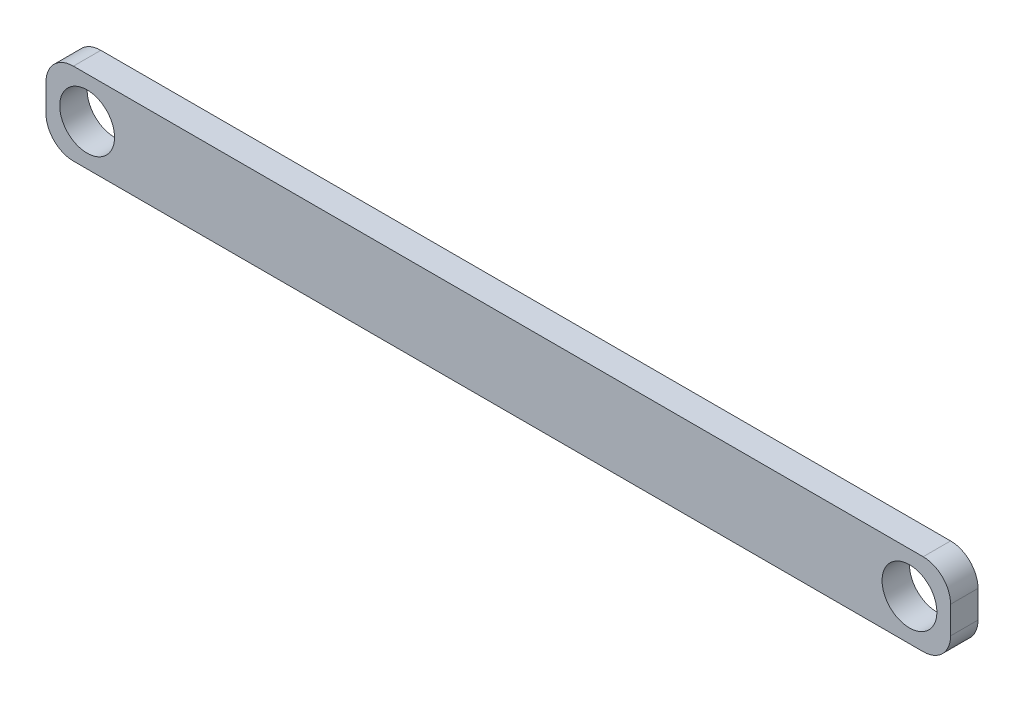
ISO-10303-21;
HEADER;
FILE_DESCRIPTION(('STEP AP214'),'2;1');
FILE_NAME('part.step','',(''),(''),'','','');
FILE_SCHEMA(('AUTOMOTIVE_DESIGN { 1 0 10303 214 1 1 1 1 }'));
ENDSEC;
DATA;
#1=APPLICATION_CONTEXT('core data for automotive mechanical design processes');
#2=APPLICATION_PROTOCOL_DEFINITION('international standard','automotive_design',2000,#1);
#3=PRODUCT_CONTEXT('',#1,'mechanical');
#4=PRODUCT('Part','Part','',(#3));
#5=PRODUCT_RELATED_PRODUCT_CATEGORY('part','',(#4));
#6=PRODUCT_DEFINITION_FORMATION('','',#4);
#7=PRODUCT_DEFINITION_CONTEXT('part definition',#1,'design');
#8=PRODUCT_DEFINITION('design','',#6,#7);
#9=PRODUCT_DEFINITION_SHAPE('','',#8);
#10=(LENGTH_UNIT() NAMED_UNIT(*) SI_UNIT(.MILLI.,.METRE.));
#11=(NAMED_UNIT(*) PLANE_ANGLE_UNIT() SI_UNIT($,.RADIAN.));
#12=(NAMED_UNIT(*) SI_UNIT($,.STERADIAN.) SOLID_ANGLE_UNIT());
#13=UNCERTAINTY_MEASURE_WITH_UNIT(LENGTH_MEASURE(1.E-05),#10,'distance_accuracy_value','');
#14=(GEOMETRIC_REPRESENTATION_CONTEXT(3) GLOBAL_UNCERTAINTY_ASSIGNED_CONTEXT((#13)) GLOBAL_UNIT_ASSIGNED_CONTEXT((#10,
#11,#12)) REPRESENTATION_CONTEXT('',''));
#15=CARTESIAN_POINT('',(0.,0.,0.));
#16=DIRECTION('',(0.,0.,1.));
#17=DIRECTION('',(1.,0.,0.));
#18=AXIS2_PLACEMENT_3D('',#15,#16,#17);
#19=CARTESIAN_POINT('',(155.,5.,5.));
#20=DIRECTION('',(0.,0.,-1.));
#21=DIRECTION('',(-1.,0.,0.));
#22=AXIS2_PLACEMENT_3D('',#19,#20,#21);
#23=PLANE('',#22);
#24=CARTESIAN_POINT('',(-150.,0.,5.));
#25=DIRECTION('',(0.,0.,1.));
#26=DIRECTION('',(1.,0.,0.));
#27=AXIS2_PLACEMENT_3D('',#24,#25,#26);
#28=CIRCLE('',#27,9.99999999999998);
#29=CARTESIAN_POINT('',(-140.,0.,5.));
#30=VERTEX_POINT('',#29);
#31=EDGE_CURVE('E133',#30,#30,#28,.T.);
#32=ORIENTED_EDGE('',*,*,#31,.F.);
#33=EDGE_LOOP('',(#32));
#34=FACE_BOUND('',#33,.T.);
#35=CARTESIAN_POINT('',(155.,5.,5.));
#36=DIRECTION('',(0.,0.,1.));
#37=DIRECTION('',(-1.,0.,0.));
#38=AXIS2_PLACEMENT_3D('',#35,#36,#37);
#39=CIRCLE('',#38,10.);
#40=CARTESIAN_POINT('',(165.,5.,5.));
#41=VERTEX_POINT('',#40);
#42=CARTESIAN_POINT('',(155.,15.,5.));
#43=VERTEX_POINT('',#42);
#44=EDGE_CURVE('E144',#41,#43,#39,.T.);
#45=ORIENTED_EDGE('',*,*,#44,.T.);
#46=DIRECTION('',(-1.,0.,0.));
#47=VECTOR('',#46,1.);
#48=CARTESIAN_POINT('',(-155.,15.,5.));
#49=LINE('',#48,#47);
#50=CARTESIAN_POINT('',(-155.,15.,5.));
#51=VERTEX_POINT('',#50);
#52=EDGE_CURVE('E92',#43,#51,#49,.T.);
#53=ORIENTED_EDGE('',*,*,#52,.T.);
#54=CARTESIAN_POINT('',(-155.,5.,5.));
#55=DIRECTION('',(0.,0.,1.));
#56=DIRECTION('',(1.,0.,0.));
#57=AXIS2_PLACEMENT_3D('',#54,#55,#56);
#58=CIRCLE('',#57,10.);
#59=CARTESIAN_POINT('',(-165.,5.,5.));
#60=VERTEX_POINT('',#59);
#61=EDGE_CURVE('E159',#51,#60,#58,.T.);
#62=ORIENTED_EDGE('',*,*,#61,.T.);
#63=DIRECTION('',(0.,-1.,0.));
#64=VECTOR('',#63,1.);
#65=CARTESIAN_POINT('',(-165.,5.,5.));
#66=LINE('',#65,#64);
#67=CARTESIAN_POINT('',(-165.,-5.,5.));
#68=VERTEX_POINT('',#67);
#69=EDGE_CURVE('E172',#60,#68,#66,.T.);
#70=ORIENTED_EDGE('',*,*,#69,.T.);
#71=CARTESIAN_POINT('',(-155.,-5.,5.));
#72=DIRECTION('',(0.,0.,1.));
#73=DIRECTION('',(-1.,0.,0.));
#74=AXIS2_PLACEMENT_3D('',#71,#72,#73);
#75=CIRCLE('',#74,10.);
#76=CARTESIAN_POINT('',(-155.,-15.,5.));
#77=VERTEX_POINT('',#76);
#78=EDGE_CURVE('E111',#68,#77,#75,.T.);
#79=ORIENTED_EDGE('',*,*,#78,.T.);
#80=DIRECTION('',(1.,0.,0.));
#81=VECTOR('',#80,1.);
#82=CARTESIAN_POINT('',(-155.,-15.,5.));
#83=LINE('',#82,#81);
#84=CARTESIAN_POINT('',(155.,-15.,5.));
#85=VERTEX_POINT('',#84);
#86=EDGE_CURVE('E105',#77,#85,#83,.T.);
#87=ORIENTED_EDGE('',*,*,#86,.T.);
#88=CARTESIAN_POINT('',(155.,-5.,5.));
#89=DIRECTION('',(0.,0.,1.));
#90=DIRECTION('',(-1.,0.,0.));
#91=AXIS2_PLACEMENT_3D('',#88,#89,#90);
#92=CIRCLE('',#91,10.);
#93=CARTESIAN_POINT('',(165.,-5.,5.));
#94=VERTEX_POINT('',#93);
#95=EDGE_CURVE('E109',#85,#94,#92,.T.);
#96=ORIENTED_EDGE('',*,*,#95,.T.);
#97=DIRECTION('',(0.,1.,0.));
#98=VECTOR('',#97,1.);
#99=CARTESIAN_POINT('',(165.,5.,5.));
#100=LINE('',#99,#98);
#101=EDGE_CURVE('E49',#94,#41,#100,.T.);
#102=ORIENTED_EDGE('',*,*,#101,.T.);
#103=EDGE_LOOP('',(#45,#53,#62,#70,#79,#87,#96,#102));
#104=FACE_BOUND('',#103,.T.);
#105=CARTESIAN_POINT('',(150.,0.,5.));
#106=DIRECTION('',(0.,0.,1.));
#107=DIRECTION('',(1.,0.,0.));
#108=AXIS2_PLACEMENT_3D('',#105,#106,#107);
#109=CIRCLE('',#108,10.);
#110=CARTESIAN_POINT('',(160.,0.,5.));
#111=VERTEX_POINT('',#110);
#112=EDGE_CURVE('E181',#111,#111,#109,.T.);
#113=ORIENTED_EDGE('',*,*,#112,.F.);
#114=EDGE_LOOP('',(#113));
#115=FACE_BOUND('',#114,.T.);
#116=ADVANCED_FACE('F32',(#34,#104,#115),#23,.F.);
#117=CARTESIAN_POINT('',(155.,5.,-5.));
#118=DIRECTION('',(0.,0.,-1.));
#119=DIRECTION('',(-1.,0.,0.));
#120=AXIS2_PLACEMENT_3D('',#117,#118,#119);
#121=PLANE('',#120);
#122=CARTESIAN_POINT('',(-150.,0.,-5.));
#123=DIRECTION('',(0.,0.,1.));
#124=DIRECTION('',(1.,0.,0.));
#125=AXIS2_PLACEMENT_3D('',#122,#123,#124);
#126=CIRCLE('',#125,9.99999999999998);
#127=CARTESIAN_POINT('',(-140.,0.,-5.));
#128=VERTEX_POINT('',#127);
#129=EDGE_CURVE('E178',#128,#128,#126,.T.);
#130=ORIENTED_EDGE('',*,*,#129,.T.);
#131=EDGE_LOOP('',(#130));
#132=FACE_BOUND('',#131,.T.);
#133=CARTESIAN_POINT('',(155.,5.,-5.));
#134=DIRECTION('',(0.,0.,1.));
#135=DIRECTION('',(-1.,0.,0.));
#136=AXIS2_PLACEMENT_3D('',#133,#134,#135);
#137=CIRCLE('',#136,10.);
#138=CARTESIAN_POINT('',(165.,5.,-5.));
#139=VERTEX_POINT('',#138);
#140=CARTESIAN_POINT('',(155.,15.,-5.));
#141=VERTEX_POINT('',#140);
#142=EDGE_CURVE('E129',#139,#141,#137,.T.);
#143=ORIENTED_EDGE('',*,*,#142,.F.);
#144=DIRECTION('',(0.,1.,0.));
#145=VECTOR('',#144,1.);
#146=CARTESIAN_POINT('',(165.,5.,-5.));
#147=LINE('',#146,#145);
#148=CARTESIAN_POINT('',(165.,-5.,-5.));
#149=VERTEX_POINT('',#148);
#150=EDGE_CURVE('E84',#149,#139,#147,.T.);
#151=ORIENTED_EDGE('',*,*,#150,.F.);
#152=CARTESIAN_POINT('',(155.,-5.,-5.));
#153=DIRECTION('',(0.,0.,1.));
#154=DIRECTION('',(-1.,0.,0.));
#155=AXIS2_PLACEMENT_3D('',#152,#153,#154);
#156=CIRCLE('',#155,10.);
#157=CARTESIAN_POINT('',(155.,-15.,-5.));
#158=VERTEX_POINT('',#157);
#159=EDGE_CURVE('E78',#158,#149,#156,.T.);
#160=ORIENTED_EDGE('',*,*,#159,.F.);
#161=DIRECTION('',(1.,0.,0.));
#162=VECTOR('',#161,1.);
#163=CARTESIAN_POINT('',(-155.,-15.,-5.));
#164=LINE('',#163,#162);
#165=CARTESIAN_POINT('',(-155.,-15.,-5.));
#166=VERTEX_POINT('',#165);
#167=EDGE_CURVE('E119',#166,#158,#164,.T.);
#168=ORIENTED_EDGE('',*,*,#167,.F.);
#169=CARTESIAN_POINT('',(-155.,-5.,-5.));
#170=DIRECTION('',(0.,0.,1.));
#171=DIRECTION('',(-1.,0.,0.));
#172=AXIS2_PLACEMENT_3D('',#169,#170,#171);
#173=CIRCLE('',#172,10.);
#174=CARTESIAN_POINT('',(-165.,-5.,-5.));
#175=VERTEX_POINT('',#174);
#176=EDGE_CURVE('E139',#175,#166,#173,.T.);
#177=ORIENTED_EDGE('',*,*,#176,.F.);
#178=DIRECTION('',(0.,-1.,0.));
#179=VECTOR('',#178,1.);
#180=CARTESIAN_POINT('',(-165.,5.,-5.));
#181=LINE('',#180,#179);
#182=CARTESIAN_POINT('',(-165.,5.,-5.));
#183=VERTEX_POINT('',#182);
#184=EDGE_CURVE('E137',#183,#175,#181,.T.);
#185=ORIENTED_EDGE('',*,*,#184,.F.);
#186=CARTESIAN_POINT('',(-155.,5.,-5.));
#187=DIRECTION('',(0.,0.,1.));
#188=DIRECTION('',(1.,0.,0.));
#189=AXIS2_PLACEMENT_3D('',#186,#187,#188);
#190=CIRCLE('',#189,10.);
#191=CARTESIAN_POINT('',(-155.,15.,-5.));
#192=VERTEX_POINT('',#191);
#193=EDGE_CURVE('E135',#192,#183,#190,.T.);
#194=ORIENTED_EDGE('',*,*,#193,.F.);
#195=DIRECTION('',(-1.,0.,0.));
#196=VECTOR('',#195,1.);
#197=CARTESIAN_POINT('',(-155.,15.,-5.));
#198=LINE('',#197,#196);
#199=EDGE_CURVE('E132',#141,#192,#198,.T.);
#200=ORIENTED_EDGE('',*,*,#199,.F.);
#201=EDGE_LOOP('',(#143,#151,#160,#168,#177,#185,#194,#200));
#202=FACE_BOUND('',#201,.T.);
#203=CARTESIAN_POINT('',(150.,0.,-5.));
#204=DIRECTION('',(0.,0.,1.));
#205=DIRECTION('',(1.,0.,0.));
#206=AXIS2_PLACEMENT_3D('',#203,#204,#205);
#207=CIRCLE('',#206,10.);
#208=CARTESIAN_POINT('',(160.,0.,-5.));
#209=VERTEX_POINT('',#208);
#210=EDGE_CURVE('E184',#209,#209,#207,.T.);
#211=ORIENTED_EDGE('',*,*,#210,.T.);
#212=EDGE_LOOP('',(#211));
#213=FACE_BOUND('',#212,.T.);
#214=ADVANCED_FACE('F163',(#132,#202,#213),#121,.T.);
#215=CARTESIAN_POINT('',(155.,5.,5.));
#216=DIRECTION('',(0.,0.,-1.));
#217=DIRECTION('',(-1.,0.,0.));
#218=AXIS2_PLACEMENT_3D('',#215,#216,#217);
#219=CYLINDRICAL_SURFACE('',#218,10.);
#220=ORIENTED_EDGE('',*,*,#142,.T.);
#221=DIRECTION('',(0.,0.,-1.));
#222=VECTOR('',#221,1.);
#223=CARTESIAN_POINT('',(155.,15.,5.));
#224=LINE('',#223,#222);
#225=EDGE_CURVE('E11',#43,#141,#224,.T.);
#226=ORIENTED_EDGE('',*,*,#225,.F.);
#227=ORIENTED_EDGE('',*,*,#44,.F.);
#228=DIRECTION('',(0.,0.,-1.));
#229=VECTOR('',#228,1.);
#230=CARTESIAN_POINT('',(165.,5.,5.));
#231=LINE('',#230,#229);
#232=EDGE_CURVE('E125',#41,#139,#231,.T.);
#233=ORIENTED_EDGE('',*,*,#232,.T.);
#234=EDGE_LOOP('',(#220,#226,#227,#233));
#235=FACE_BOUND('',#234,.T.);
#236=ADVANCED_FACE('F34',(#235),#219,.T.);
#237=CARTESIAN_POINT('',(-155.,15.,5.));
#238=DIRECTION('',(0.,-1.,0.));
#239=DIRECTION('',(0.,0.,-1.));
#240=AXIS2_PLACEMENT_3D('',#237,#238,#239);
#241=PLANE('',#240);
#242=ORIENTED_EDGE('',*,*,#199,.T.);
#243=DIRECTION('',(0.,0.,-1.));
#244=VECTOR('',#243,1.);
#245=CARTESIAN_POINT('',(-155.,15.,5.));
#246=LINE('',#245,#244);
#247=EDGE_CURVE('E41',#51,#192,#246,.T.);
#248=ORIENTED_EDGE('',*,*,#247,.F.);
#249=ORIENTED_EDGE('',*,*,#52,.F.);
#250=ORIENTED_EDGE('',*,*,#225,.T.);
#251=EDGE_LOOP('',(#242,#248,#249,#250));
#252=FACE_BOUND('',#251,.T.);
#253=ADVANCED_FACE('F217',(#252),#241,.F.);
#254=CARTESIAN_POINT('',(-155.,5.,5.));
#255=DIRECTION('',(0.,0.,-1.));
#256=DIRECTION('',(-1.,0.,0.));
#257=AXIS2_PLACEMENT_3D('',#254,#255,#256);
#258=CYLINDRICAL_SURFACE('',#257,10.);
#259=ORIENTED_EDGE('',*,*,#193,.T.);
#260=DIRECTION('',(0.,0.,-1.));
#261=VECTOR('',#260,1.);
#262=CARTESIAN_POINT('',(-165.,5.,5.));
#263=LINE('',#262,#261);
#264=EDGE_CURVE('E151',#60,#183,#263,.T.);
#265=ORIENTED_EDGE('',*,*,#264,.F.);
#266=ORIENTED_EDGE('',*,*,#61,.F.);
#267=ORIENTED_EDGE('',*,*,#247,.T.);
#268=EDGE_LOOP('',(#259,#265,#266,#267));
#269=FACE_BOUND('',#268,.T.);
#270=ADVANCED_FACE('F157',(#269),#258,.T.);
#271=CARTESIAN_POINT('',(-165.,5.,5.));
#272=DIRECTION('',(1.,0.,0.));
#273=DIRECTION('',(0.,0.,-1.));
#274=AXIS2_PLACEMENT_3D('',#271,#272,#273);
#275=PLANE('',#274);
#276=ORIENTED_EDGE('',*,*,#184,.T.);
#277=DIRECTION('',(0.,0.,-1.));
#278=VECTOR('',#277,1.);
#279=CARTESIAN_POINT('',(-165.,-5.,5.));
#280=LINE('',#279,#278);
#281=EDGE_CURVE('E148',#68,#175,#280,.T.);
#282=ORIENTED_EDGE('',*,*,#281,.F.);
#283=ORIENTED_EDGE('',*,*,#69,.F.);
#284=ORIENTED_EDGE('',*,*,#264,.T.);
#285=EDGE_LOOP('',(#276,#282,#283,#284));
#286=FACE_BOUND('',#285,.T.);
#287=ADVANCED_FACE('F168',(#286),#275,.F.);
#288=CARTESIAN_POINT('',(-155.,-5.,5.));
#289=DIRECTION('',(0.,0.,-1.));
#290=DIRECTION('',(-1.,0.,0.));
#291=AXIS2_PLACEMENT_3D('',#288,#289,#290);
#292=CYLINDRICAL_SURFACE('',#291,10.);
#293=ORIENTED_EDGE('',*,*,#176,.T.);
#294=DIRECTION('',(0.,0.,-1.));
#295=VECTOR('',#294,1.);
#296=CARTESIAN_POINT('',(-155.,-15.,5.));
#297=LINE('',#296,#295);
#298=EDGE_CURVE('E120',#77,#166,#297,.T.);
#299=ORIENTED_EDGE('',*,*,#298,.F.);
#300=ORIENTED_EDGE('',*,*,#78,.F.);
#301=ORIENTED_EDGE('',*,*,#281,.T.);
#302=EDGE_LOOP('',(#293,#299,#300,#301));
#303=FACE_BOUND('',#302,.T.);
#304=ADVANCED_FACE('F171',(#303),#292,.T.);
#305=CARTESIAN_POINT('',(-155.,-15.,5.));
#306=DIRECTION('',(0.,1.,0.));
#307=DIRECTION('',(0.,0.,1.));
#308=AXIS2_PLACEMENT_3D('',#305,#306,#307);
#309=PLANE('',#308);
#310=ORIENTED_EDGE('',*,*,#167,.T.);
#311=DIRECTION('',(0.,0.,-1.));
#312=VECTOR('',#311,1.);
#313=CARTESIAN_POINT('',(155.,-15.,5.));
#314=LINE('',#313,#312);
#315=EDGE_CURVE('E116',#85,#158,#314,.T.);
#316=ORIENTED_EDGE('',*,*,#315,.F.);
#317=ORIENTED_EDGE('',*,*,#86,.F.);
#318=ORIENTED_EDGE('',*,*,#298,.T.);
#319=EDGE_LOOP('',(#310,#316,#317,#318));
#320=FACE_BOUND('',#319,.T.);
#321=ADVANCED_FACE('F117',(#320),#309,.F.);
#322=CARTESIAN_POINT('',(155.,-5.,5.));
#323=DIRECTION('',(0.,0.,-1.));
#324=DIRECTION('',(-1.,0.,0.));
#325=AXIS2_PLACEMENT_3D('',#322,#323,#324);
#326=CYLINDRICAL_SURFACE('',#325,10.);
#327=ORIENTED_EDGE('',*,*,#159,.T.);
#328=DIRECTION('',(0.,0.,-1.));
#329=VECTOR('',#328,1.);
#330=CARTESIAN_POINT('',(165.,-5.,5.));
#331=LINE('',#330,#329);
#332=EDGE_CURVE('E121',#94,#149,#331,.T.);
#333=ORIENTED_EDGE('',*,*,#332,.F.);
#334=ORIENTED_EDGE('',*,*,#95,.F.);
#335=ORIENTED_EDGE('',*,*,#315,.T.);
#336=EDGE_LOOP('',(#327,#333,#334,#335));
#337=FACE_BOUND('',#336,.T.);
#338=ADVANCED_FACE('F123',(#337),#326,.T.);
#339=CARTESIAN_POINT('',(165.,5.,5.));
#340=DIRECTION('',(-1.,0.,0.));
#341=DIRECTION('',(0.,0.,1.));
#342=AXIS2_PLACEMENT_3D('',#339,#340,#341);
#343=PLANE('',#342);
#344=ORIENTED_EDGE('',*,*,#150,.T.);
#345=ORIENTED_EDGE('',*,*,#232,.F.);
#346=ORIENTED_EDGE('',*,*,#101,.F.);
#347=ORIENTED_EDGE('',*,*,#332,.T.);
#348=EDGE_LOOP('',(#344,#345,#346,#347));
#349=FACE_BOUND('',#348,.T.);
#350=ADVANCED_FACE('F205',(#349),#343,.F.);
#351=CARTESIAN_POINT('',(-150.,0.,5.));
#352=DIRECTION('',(0.,0.,-1.));
#353=DIRECTION('',(-1.,0.,0.));
#354=AXIS2_PLACEMENT_3D('',#351,#352,#353);
#355=CYLINDRICAL_SURFACE('',#354,9.99999999999998);
#356=ORIENTED_EDGE('',*,*,#31,.T.);
#357=EDGE_LOOP('',(#356));
#358=FACE_BOUND('',#357,.T.);
#359=ORIENTED_EDGE('',*,*,#129,.F.);
#360=EDGE_LOOP('',(#359));
#361=FACE_BOUND('',#360,.T.);
#362=ADVANCED_FACE('F202',(#358,#361),#355,.F.);
#363=CARTESIAN_POINT('',(150.,0.,5.));
#364=DIRECTION('',(0.,0.,-1.));
#365=DIRECTION('',(-1.,0.,0.));
#366=AXIS2_PLACEMENT_3D('',#363,#364,#365);
#367=CYLINDRICAL_SURFACE('',#366,10.);
#368=ORIENTED_EDGE('',*,*,#112,.T.);
#369=EDGE_LOOP('',(#368));
#370=FACE_BOUND('',#369,.T.);
#371=ORIENTED_EDGE('',*,*,#210,.F.);
#372=EDGE_LOOP('',(#371));
#373=FACE_BOUND('',#372,.T.);
#374=ADVANCED_FACE('F190',(#370,#373),#367,.F.);
#375=CLOSED_SHELL('',(#116,#214,#236,#253,#270,#287,#304,#321,#338,#350,#362,#374));
#376=MANIFOLD_SOLID_BREP('B2',#375);
#377=ADVANCED_BREP_SHAPE_REPRESENTATION('',(#18,#376),#14);
#378=SHAPE_DEFINITION_REPRESENTATION(#9,#377);
ENDSEC;
END-ISO-10303-21;
